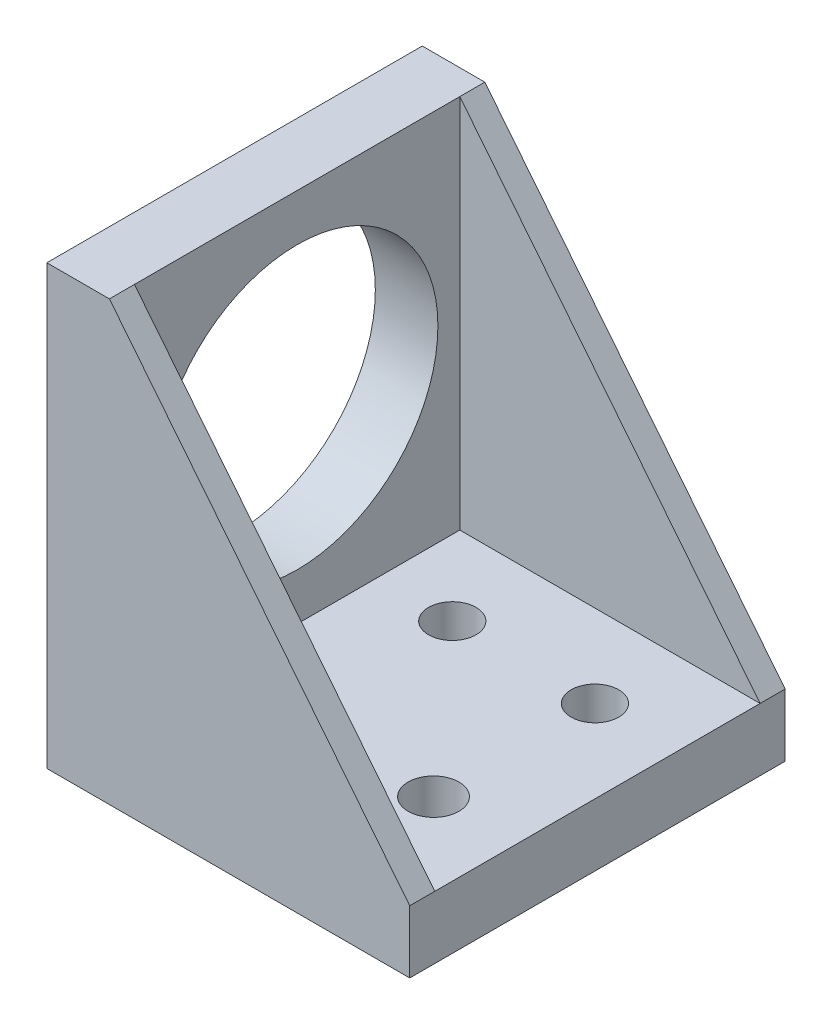
ISO-10303-21;
HEADER;
FILE_DESCRIPTION(('STEP AP214'),'2;1');
FILE_NAME('part.step','',(''),(''),'','','');
FILE_SCHEMA(('AUTOMOTIVE_DESIGN { 1 0 10303 214 1 1 1 1 }'));
ENDSEC;
DATA;
#1=APPLICATION_CONTEXT('core data for automotive mechanical design processes');
#2=APPLICATION_PROTOCOL_DEFINITION('international standard','automotive_design',2000,#1);
#3=PRODUCT_CONTEXT('',#1,'mechanical');
#4=PRODUCT('Part','Part','',(#3));
#5=PRODUCT_RELATED_PRODUCT_CATEGORY('part','',(#4));
#6=PRODUCT_DEFINITION_FORMATION('','',#4);
#7=PRODUCT_DEFINITION_CONTEXT('part definition',#1,'design');
#8=PRODUCT_DEFINITION('design','',#6,#7);
#9=PRODUCT_DEFINITION_SHAPE('','',#8);
#10=(LENGTH_UNIT() NAMED_UNIT(*) SI_UNIT(.MILLI.,.METRE.));
#11=(NAMED_UNIT(*) PLANE_ANGLE_UNIT() SI_UNIT($,.RADIAN.));
#12=(NAMED_UNIT(*) SI_UNIT($,.STERADIAN.) SOLID_ANGLE_UNIT());
#13=UNCERTAINTY_MEASURE_WITH_UNIT(LENGTH_MEASURE(1.E-05),#10,'distance_accuracy_value','');
#14=(GEOMETRIC_REPRESENTATION_CONTEXT(3) GLOBAL_UNCERTAINTY_ASSIGNED_CONTEXT((#13)) GLOBAL_UNIT_ASSIGNED_CONTEXT((#10,
#11,#12)) REPRESENTATION_CONTEXT('',''));
#15=CARTESIAN_POINT('',(0.,0.,0.));
#16=DIRECTION('',(0.,0.,1.));
#17=DIRECTION('',(1.,0.,0.));
#18=AXIS2_PLACEMENT_3D('',#15,#16,#17);
#19=CARTESIAN_POINT('',(30.48,0.,-19.05));
#20=DIRECTION('',(0.,0.,-1.));
#21=DIRECTION('',(0.,1.,0.));
#22=AXIS2_PLACEMENT_3D('',#19,#20,#21);
#23=PLANE('',#22);
#24=DIRECTION('',(-1.,0.,0.));
#25=VECTOR('',#24,1.);
#26=CARTESIAN_POINT('',(30.48,-25.4,-19.05));
#27=LINE('',#26,#25);
#28=CARTESIAN_POINT('',(30.48,-25.4,-19.05));
#29=VERTEX_POINT('',#28);
#30=CARTESIAN_POINT('',(-6.35,-25.4,-19.05));
#31=VERTEX_POINT('',#30);
#32=EDGE_CURVE('E49',#29,#31,#27,.T.);
#33=ORIENTED_EDGE('',*,*,#32,.T.);
#34=DIRECTION('',(0.,1.,0.));
#35=VECTOR('',#34,1.);
#36=CARTESIAN_POINT('',(-6.35,-25.4,-19.05));
#37=LINE('',#36,#35);
#38=CARTESIAN_POINT('',(-6.35,19.05,-19.05));
#39=VERTEX_POINT('',#38);
#40=EDGE_CURVE('E158',#31,#39,#37,.T.);
#41=ORIENTED_EDGE('',*,*,#40,.T.);
#42=DIRECTION('',(1.,0.,0.));
#43=VECTOR('',#42,1.);
#44=CARTESIAN_POINT('',(-6.35,19.05,-19.05));
#45=LINE('',#44,#43);
#46=CARTESIAN_POINT('',(0.,19.05,-19.05));
#47=VERTEX_POINT('',#46);
#48=EDGE_CURVE('E147',#39,#47,#45,.T.);
#49=ORIENTED_EDGE('',*,*,#48,.T.);
#50=DIRECTION('',(0.624695047554424,-0.78086880944303,0.));
#51=VECTOR('',#50,1.);
#52=CARTESIAN_POINT('',(0.,19.05,-19.05));
#53=LINE('',#52,#51);
#54=CARTESIAN_POINT('',(30.48,-19.05,-19.05));
#55=VERTEX_POINT('',#54);
#56=EDGE_CURVE('E112',#47,#55,#53,.T.);
#57=ORIENTED_EDGE('',*,*,#56,.T.);
#58=DIRECTION('',(0.,-1.,0.));
#59=VECTOR('',#58,1.);
#60=CARTESIAN_POINT('',(30.48,0.,-19.05));
#61=LINE('',#60,#59);
#62=EDGE_CURVE('E162',#55,#29,#61,.T.);
#63=ORIENTED_EDGE('',*,*,#62,.T.);
#64=EDGE_LOOP('',(#33,#41,#49,#57,#63));
#65=FACE_BOUND('',#64,.T.);
#66=ADVANCED_FACE('F41',(#65),#23,.T.);
#67=CARTESIAN_POINT('',(30.48,-19.05,0.));
#68=DIRECTION('',(0.,-1.,0.));
#69=DIRECTION('',(0.,0.,-1.));
#70=AXIS2_PLACEMENT_3D('',#67,#68,#69);
#71=PLANE('',#70);
#72=CARTESIAN_POINT('',(7.62,-19.05,-8.12799999999999));
#73=DIRECTION('',(0.,1.,0.));
#74=DIRECTION('',(0.,0.,1.));
#75=AXIS2_PLACEMENT_3D('',#72,#73,#74);
#76=CIRCLE('',#75,2.413);
#77=CARTESIAN_POINT('',(7.62,-19.05,-5.71499999999999));
#78=VERTEX_POINT('',#77);
#79=EDGE_CURVE('E239',#78,#78,#76,.T.);
#80=ORIENTED_EDGE('',*,*,#79,.F.);
#81=EDGE_LOOP('',(#80));
#82=FACE_BOUND('',#81,.T.);
#83=CARTESIAN_POINT('',(22.098,-19.05,-8.12799999999999));
#84=DIRECTION('',(0.,1.,0.));
#85=DIRECTION('',(0.,0.,1.));
#86=AXIS2_PLACEMENT_3D('',#83,#84,#85);
#87=CIRCLE('',#86,2.413);
#88=CARTESIAN_POINT('',(22.098,-19.05,-5.71499999999999));
#89=VERTEX_POINT('',#88);
#90=EDGE_CURVE('E247',#89,#89,#87,.T.);
#91=ORIENTED_EDGE('',*,*,#90,.F.);
#92=EDGE_LOOP('',(#91));
#93=FACE_BOUND('',#92,.T.);
#94=CARTESIAN_POINT('',(22.098,-19.05,8.25500000000001));
#95=DIRECTION('',(0.,1.,0.));
#96=DIRECTION('',(0.,0.,1.));
#97=AXIS2_PLACEMENT_3D('',#94,#95,#96);
#98=CIRCLE('',#97,2.57968749999999);
#99=CARTESIAN_POINT('',(22.098,-19.05,10.8346875));
#100=VERTEX_POINT('',#99);
#101=EDGE_CURVE('E231',#100,#100,#98,.T.);
#102=ORIENTED_EDGE('',*,*,#101,.F.);
#103=EDGE_LOOP('',(#102));
#104=FACE_BOUND('',#103,.T.);
#105=CARTESIAN_POINT('',(7.62,-19.05,8.25500000000001));
#106=DIRECTION('',(0.,1.,0.));
#107=DIRECTION('',(0.,0.,1.));
#108=AXIS2_PLACEMENT_3D('',#105,#106,#107);
#109=CIRCLE('',#108,2.413);
#110=CARTESIAN_POINT('',(7.62,-19.05,10.668));
#111=VERTEX_POINT('',#110);
#112=EDGE_CURVE('E227',#111,#111,#109,.T.);
#113=ORIENTED_EDGE('',*,*,#112,.F.);
#114=EDGE_LOOP('',(#113));
#115=FACE_BOUND('',#114,.T.);
#116=DIRECTION('',(0.,0.,1.));
#117=VECTOR('',#116,1.);
#118=CARTESIAN_POINT('',(30.48,-19.05,0.));
#119=LINE('',#118,#117);
#120=CARTESIAN_POINT('',(30.48,-19.05,-16.51));
#121=VERTEX_POINT('',#120);
#122=CARTESIAN_POINT('',(30.48,-19.05,16.51));
#123=VERTEX_POINT('',#122);
#124=EDGE_CURVE('E56',#121,#123,#119,.T.);
#125=ORIENTED_EDGE('',*,*,#124,.F.);
#126=DIRECTION('',(-1.,0.,0.));
#127=VECTOR('',#126,1.);
#128=CARTESIAN_POINT('',(30.48,-19.05,-16.51));
#129=LINE('',#128,#127);
#130=CARTESIAN_POINT('',(0.,-19.05,-16.51));
#131=VERTEX_POINT('',#130);
#132=EDGE_CURVE('E124',#121,#131,#129,.T.);
#133=ORIENTED_EDGE('',*,*,#132,.T.);
#134=DIRECTION('',(0.,0.,1.));
#135=VECTOR('',#134,1.);
#136=CARTESIAN_POINT('',(0.,-19.05,0.));
#137=LINE('',#136,#135);
#138=CARTESIAN_POINT('',(0.,-19.05,16.51));
#139=VERTEX_POINT('',#138);
#140=EDGE_CURVE('E63',#131,#139,#137,.T.);
#141=ORIENTED_EDGE('',*,*,#140,.T.);
#142=DIRECTION('',(-1.,0.,0.));
#143=VECTOR('',#142,1.);
#144=CARTESIAN_POINT('',(30.48,-19.05,16.51));
#145=LINE('',#144,#143);
#146=EDGE_CURVE('E212',#123,#139,#145,.T.);
#147=ORIENTED_EDGE('',*,*,#146,.F.);
#148=EDGE_LOOP('',(#125,#133,#141,#147));
#149=FACE_BOUND('',#148,.T.);
#150=ADVANCED_FACE('F261',(#82,#93,#104,#115,#149),#71,.F.);
#151=CARTESIAN_POINT('',(30.48,0.,19.05));
#152=DIRECTION('',(0.,0.,-1.));
#153=DIRECTION('',(0.,1.,0.));
#154=AXIS2_PLACEMENT_3D('',#151,#152,#153);
#155=PLANE('',#154);
#156=DIRECTION('',(0.,-1.,0.));
#157=VECTOR('',#156,1.);
#158=CARTESIAN_POINT('',(30.48,0.,19.05));
#159=LINE('',#158,#157);
#160=CARTESIAN_POINT('',(30.48,-19.05,19.05));
#161=VERTEX_POINT('',#160);
#162=CARTESIAN_POINT('',(30.48,-25.4,19.05));
#163=VERTEX_POINT('',#162);
#164=EDGE_CURVE('E171',#161,#163,#159,.T.);
#165=ORIENTED_EDGE('',*,*,#164,.F.);
#166=DIRECTION('',(0.624695047554424,-0.78086880944303,0.));
#167=VECTOR('',#166,1.);
#168=CARTESIAN_POINT('',(0.,19.05,19.05));
#169=LINE('',#168,#167);
#170=CARTESIAN_POINT('',(0.,19.05,19.05));
#171=VERTEX_POINT('',#170);
#172=EDGE_CURVE('E198',#171,#161,#169,.T.);
#173=ORIENTED_EDGE('',*,*,#172,.F.);
#174=DIRECTION('',(1.,0.,0.));
#175=VECTOR('',#174,1.);
#176=CARTESIAN_POINT('',(-6.35,19.05,19.05));
#177=LINE('',#176,#175);
#178=CARTESIAN_POINT('',(-6.35,19.05,19.05));
#179=VERTEX_POINT('',#178);
#180=EDGE_CURVE('E151',#179,#171,#177,.T.);
#181=ORIENTED_EDGE('',*,*,#180,.F.);
#182=DIRECTION('',(0.,1.,0.));
#183=VECTOR('',#182,1.);
#184=CARTESIAN_POINT('',(-6.35,-25.4,19.05));
#185=LINE('',#184,#183);
#186=CARTESIAN_POINT('',(-6.35,-25.4,19.05));
#187=VERTEX_POINT('',#186);
#188=EDGE_CURVE('E159',#187,#179,#185,.T.);
#189=ORIENTED_EDGE('',*,*,#188,.F.);
#190=DIRECTION('',(-1.,0.,0.));
#191=VECTOR('',#190,1.);
#192=CARTESIAN_POINT('',(30.48,-25.4,19.05));
#193=LINE('',#192,#191);
#194=EDGE_CURVE('E11',#163,#187,#193,.T.);
#195=ORIENTED_EDGE('',*,*,#194,.F.);
#196=EDGE_LOOP('',(#165,#173,#181,#189,#195));
#197=FACE_BOUND('',#196,.T.);
#198=ADVANCED_FACE('F195',(#197),#155,.F.);
#199=CARTESIAN_POINT('',(30.48,-25.4,0.));
#200=DIRECTION('',(0.,1.,0.));
#201=DIRECTION('',(0.,0.,1.));
#202=AXIS2_PLACEMENT_3D('',#199,#200,#201);
#203=PLANE('',#202);
#204=CARTESIAN_POINT('',(7.62,-25.4,-8.12799999999999));
#205=DIRECTION('',(0.,1.,0.));
#206=DIRECTION('',(0.,0.,1.));
#207=AXIS2_PLACEMENT_3D('',#204,#205,#206);
#208=CIRCLE('',#207,2.413);
#209=CARTESIAN_POINT('',(7.62,-25.4,-5.71499999999999));
#210=VERTEX_POINT('',#209);
#211=EDGE_CURVE('E235',#210,#210,#208,.T.);
#212=ORIENTED_EDGE('',*,*,#211,.T.);
#213=EDGE_LOOP('',(#212));
#214=FACE_BOUND('',#213,.T.);
#215=CARTESIAN_POINT('',(22.098,-25.4,-8.12799999999999));
#216=DIRECTION('',(0.,1.,0.));
#217=DIRECTION('',(0.,0.,1.));
#218=AXIS2_PLACEMENT_3D('',#215,#216,#217);
#219=CIRCLE('',#218,2.413);
#220=CARTESIAN_POINT('',(22.098,-25.4,-5.71499999999999));
#221=VERTEX_POINT('',#220);
#222=EDGE_CURVE('E243',#221,#221,#219,.T.);
#223=ORIENTED_EDGE('',*,*,#222,.T.);
#224=EDGE_LOOP('',(#223));
#225=FACE_BOUND('',#224,.T.);
#226=CARTESIAN_POINT('',(22.098,-25.4,8.25500000000001));
#227=DIRECTION('',(0.,1.,0.));
#228=DIRECTION('',(0.,0.,1.));
#229=AXIS2_PLACEMENT_3D('',#226,#227,#228);
#230=CIRCLE('',#229,2.57968749999999);
#231=CARTESIAN_POINT('',(22.098,-25.4,10.8346875));
#232=VERTEX_POINT('',#231);
#233=EDGE_CURVE('E251',#232,#232,#230,.T.);
#234=ORIENTED_EDGE('',*,*,#233,.T.);
#235=EDGE_LOOP('',(#234));
#236=FACE_BOUND('',#235,.T.);
#237=CARTESIAN_POINT('',(7.62,-25.4,8.25500000000001));
#238=DIRECTION('',(0.,1.,0.));
#239=DIRECTION('',(0.,0.,1.));
#240=AXIS2_PLACEMENT_3D('',#237,#238,#239);
#241=CIRCLE('',#240,2.413);
#242=CARTESIAN_POINT('',(7.62,-25.4,10.668));
#243=VERTEX_POINT('',#242);
#244=EDGE_CURVE('E224',#243,#243,#241,.T.);
#245=ORIENTED_EDGE('',*,*,#244,.T.);
#246=EDGE_LOOP('',(#245));
#247=FACE_BOUND('',#246,.T.);
#248=ORIENTED_EDGE('',*,*,#194,.T.);
#249=DIRECTION('',(0.,0.,1.));
#250=VECTOR('',#249,1.);
#251=CARTESIAN_POINT('',(-6.35,-25.4,-19.05));
#252=LINE('',#251,#250);
#253=EDGE_CURVE('E150',#31,#187,#252,.T.);
#254=ORIENTED_EDGE('',*,*,#253,.F.);
#255=ORIENTED_EDGE('',*,*,#32,.F.);
#256=DIRECTION('',(0.,0.,-1.));
#257=VECTOR('',#256,1.);
#258=CARTESIAN_POINT('',(30.48,-25.4,0.));
#259=LINE('',#258,#257);
#260=EDGE_CURVE('E174',#163,#29,#259,.T.);
#261=ORIENTED_EDGE('',*,*,#260,.F.);
#262=EDGE_LOOP('',(#248,#254,#255,#261));
#263=FACE_BOUND('',#262,.T.);
#264=ADVANCED_FACE('F189',(#214,#225,#236,#247,#263),#203,.F.);
#265=CARTESIAN_POINT('',(30.48,0.,0.));
#266=DIRECTION('',(1.,0.,0.));
#267=DIRECTION('',(0.,0.,-1.));
#268=AXIS2_PLACEMENT_3D('',#265,#266,#267);
#269=PLANE('',#268);
#270=ORIENTED_EDGE('',*,*,#62,.F.);
#271=EDGE_CURVE('E168',#55,#121,#119,.T.);
#272=ORIENTED_EDGE('',*,*,#271,.T.);
#273=ORIENTED_EDGE('',*,*,#124,.T.);
#274=DIRECTION('',(0.,0.,1.));
#275=VECTOR('',#274,1.);
#276=CARTESIAN_POINT('',(30.48,-19.05,16.51));
#277=LINE('',#276,#275);
#278=EDGE_CURVE('E206',#123,#161,#277,.T.);
#279=ORIENTED_EDGE('',*,*,#278,.T.);
#280=ORIENTED_EDGE('',*,*,#164,.T.);
#281=ORIENTED_EDGE('',*,*,#260,.T.);
#282=EDGE_LOOP('',(#270,#272,#273,#279,#280,#281));
#283=FACE_BOUND('',#282,.T.);
#284=ADVANCED_FACE('F267',(#283),#269,.T.);
#285=CARTESIAN_POINT('',(-6.35,-25.4,-19.05));
#286=DIRECTION('',(-1.,0.,0.));
#287=DIRECTION('',(0.,0.,1.));
#288=AXIS2_PLACEMENT_3D('',#285,#286,#287);
#289=PLANE('',#288);
#290=ORIENTED_EDGE('',*,*,#188,.T.);
#291=DIRECTION('',(0.,0.,1.));
#292=VECTOR('',#291,1.);
#293=CARTESIAN_POINT('',(-6.35,19.05,0.));
#294=LINE('',#293,#292);
#295=EDGE_CURVE('E154',#39,#179,#294,.T.);
#296=ORIENTED_EDGE('',*,*,#295,.F.);
#297=ORIENTED_EDGE('',*,*,#40,.F.);
#298=ORIENTED_EDGE('',*,*,#253,.T.);
#299=EDGE_LOOP('',(#290,#296,#297,#298));
#300=FACE_BOUND('',#299,.T.);
#301=CARTESIAN_POINT('',(-6.35,0.,0.));
#302=DIRECTION('',(1.,0.,0.));
#303=DIRECTION('',(0.,0.,-1.));
#304=AXIS2_PLACEMENT_3D('',#301,#302,#303);
#305=CIRCLE('',#304,14.2875);
#306=CARTESIAN_POINT('',(-6.35,0.,-14.2875));
#307=VERTEX_POINT('',#306);
#308=EDGE_CURVE('E146',#307,#307,#305,.T.);
#309=ORIENTED_EDGE('',*,*,#308,.T.);
#310=EDGE_LOOP('',(#309));
#311=FACE_BOUND('',#310,.T.);
#312=ADVANCED_FACE('F186',(#300,#311),#289,.T.);
#313=CARTESIAN_POINT('',(-6.35,19.05,0.));
#314=DIRECTION('',(0.,1.,0.));
#315=DIRECTION('',(0.,0.,1.));
#316=AXIS2_PLACEMENT_3D('',#313,#314,#315);
#317=PLANE('',#316);
#318=DIRECTION('',(0.,0.,1.));
#319=VECTOR('',#318,1.);
#320=CARTESIAN_POINT('',(0.,19.05,0.));
#321=LINE('',#320,#319);
#322=CARTESIAN_POINT('',(0.,19.05,-16.51));
#323=VERTEX_POINT('',#322);
#324=EDGE_CURVE('E106',#47,#323,#321,.T.);
#325=ORIENTED_EDGE('',*,*,#324,.F.);
#326=ORIENTED_EDGE('',*,*,#48,.F.);
#327=ORIENTED_EDGE('',*,*,#295,.T.);
#328=ORIENTED_EDGE('',*,*,#180,.T.);
#329=DIRECTION('',(0.,0.,1.));
#330=VECTOR('',#329,1.);
#331=CARTESIAN_POINT('',(0.,19.05,16.51));
#332=LINE('',#331,#330);
#333=CARTESIAN_POINT('',(0.,19.05,16.51));
#334=VERTEX_POINT('',#333);
#335=EDGE_CURVE('E135',#334,#171,#332,.T.);
#336=ORIENTED_EDGE('',*,*,#335,.F.);
#337=EDGE_CURVE('E118',#323,#334,#321,.T.);
#338=ORIENTED_EDGE('',*,*,#337,.F.);
#339=EDGE_LOOP('',(#325,#326,#327,#328,#336,#338));
#340=FACE_BOUND('',#339,.T.);
#341=ADVANCED_FACE('F133',(#340),#317,.T.);
#342=CARTESIAN_POINT('',(-6.35,0.,0.));
#343=DIRECTION('',(1.,0.,0.));
#344=DIRECTION('',(0.,0.,-1.));
#345=AXIS2_PLACEMENT_3D('',#342,#343,#344);
#346=CYLINDRICAL_SURFACE('',#345,14.2875);
#347=ORIENTED_EDGE('',*,*,#308,.F.);
#348=EDGE_LOOP('',(#347));
#349=FACE_BOUND('',#348,.T.);
#350=CARTESIAN_POINT('',(0.,0.,0.));
#351=DIRECTION('',(1.,0.,0.));
#352=DIRECTION('',(0.,0.,-1.));
#353=AXIS2_PLACEMENT_3D('',#350,#351,#352);
#354=CIRCLE('',#353,14.2875);
#355=CARTESIAN_POINT('',(0.,0.,-14.2875));
#356=VERTEX_POINT('',#355);
#357=EDGE_CURVE('E138',#356,#356,#354,.T.);
#358=ORIENTED_EDGE('',*,*,#357,.T.);
#359=EDGE_LOOP('',(#358));
#360=FACE_BOUND('',#359,.T.);
#361=ADVANCED_FACE('F324',(#349,#360),#346,.F.);
#362=CARTESIAN_POINT('',(0.,0.,0.));
#363=DIRECTION('',(1.,0.,0.));
#364=DIRECTION('',(0.,0.,-1.));
#365=AXIS2_PLACEMENT_3D('',#362,#363,#364);
#366=PLANE('',#365);
#367=DIRECTION('',(0.,1.,0.));
#368=VECTOR('',#367,1.);
#369=CARTESIAN_POINT('',(0.,-19.05,-16.51));
#370=LINE('',#369,#368);
#371=EDGE_CURVE('E123',#131,#323,#370,.T.);
#372=ORIENTED_EDGE('',*,*,#371,.T.);
#373=ORIENTED_EDGE('',*,*,#337,.T.);
#374=DIRECTION('',(0.,1.,0.));
#375=VECTOR('',#374,1.);
#376=CARTESIAN_POINT('',(0.,-19.05,16.51));
#377=LINE('',#376,#375);
#378=EDGE_CURVE('E216',#139,#334,#377,.T.);
#379=ORIENTED_EDGE('',*,*,#378,.F.);
#380=ORIENTED_EDGE('',*,*,#140,.F.);
#381=EDGE_LOOP('',(#372,#373,#379,#380));
#382=FACE_BOUND('',#381,.T.);
#383=ORIENTED_EDGE('',*,*,#357,.F.);
#384=EDGE_LOOP('',(#383));
#385=FACE_BOUND('',#384,.T.);
#386=ADVANCED_FACE('F128',(#382,#385),#366,.T.);
#387=CARTESIAN_POINT('',(0.,19.05,16.51));
#388=DIRECTION('',(-0.78086880944303,-0.624695047554424,0.));
#389=DIRECTION('',(0.624695047554424,-0.78086880944303,0.));
#390=AXIS2_PLACEMENT_3D('',#387,#388,#389);
#391=PLANE('',#390);
#392=ORIENTED_EDGE('',*,*,#172,.T.);
#393=ORIENTED_EDGE('',*,*,#278,.F.);
#394=DIRECTION('',(0.624695047554424,-0.78086880944303,0.));
#395=VECTOR('',#394,1.);
#396=CARTESIAN_POINT('',(0.,19.05,16.51));
#397=LINE('',#396,#395);
#398=EDGE_CURVE('E209',#334,#123,#397,.T.);
#399=ORIENTED_EDGE('',*,*,#398,.F.);
#400=ORIENTED_EDGE('',*,*,#335,.T.);
#401=EDGE_LOOP('',(#392,#393,#399,#400));
#402=FACE_BOUND('',#401,.T.);
#403=ADVANCED_FACE('F270',(#402),#391,.F.);
#404=CARTESIAN_POINT('',(0.,0.,16.51));
#405=DIRECTION('',(0.,0.,-1.));
#406=DIRECTION('',(-1.,0.,0.));
#407=AXIS2_PLACEMENT_3D('',#404,#405,#406);
#408=PLANE('',#407);
#409=ORIENTED_EDGE('',*,*,#146,.T.);
#410=ORIENTED_EDGE('',*,*,#378,.T.);
#411=ORIENTED_EDGE('',*,*,#398,.T.);
#412=EDGE_LOOP('',(#409,#410,#411));
#413=FACE_BOUND('',#412,.T.);
#414=ADVANCED_FACE('F273',(#413),#408,.T.);
#415=CARTESIAN_POINT('',(0.,19.05,-16.51));
#416=DIRECTION('',(0.78086880944303,0.624695047554424,0.));
#417=DIRECTION('',(-0.624695047554424,0.78086880944303,0.));
#418=AXIS2_PLACEMENT_3D('',#415,#416,#417);
#419=PLANE('',#418);
#420=ORIENTED_EDGE('',*,*,#56,.F.);
#421=ORIENTED_EDGE('',*,*,#324,.T.);
#422=DIRECTION('',(0.624695047554424,-0.78086880944303,0.));
#423=VECTOR('',#422,1.);
#424=CARTESIAN_POINT('',(0.,19.05,-16.51));
#425=LINE('',#424,#423);
#426=EDGE_CURVE('E109',#323,#121,#425,.T.);
#427=ORIENTED_EDGE('',*,*,#426,.T.);
#428=ORIENTED_EDGE('',*,*,#271,.F.);
#429=EDGE_LOOP('',(#420,#421,#427,#428));
#430=FACE_BOUND('',#429,.T.);
#431=ADVANCED_FACE('F108',(#430),#419,.T.);
#432=CARTESIAN_POINT('',(0.,0.,-16.51));
#433=DIRECTION('',(0.,0.,1.));
#434=DIRECTION('',(1.,0.,0.));
#435=AXIS2_PLACEMENT_3D('',#432,#433,#434);
#436=PLANE('',#435);
#437=ORIENTED_EDGE('',*,*,#371,.F.);
#438=ORIENTED_EDGE('',*,*,#132,.F.);
#439=ORIENTED_EDGE('',*,*,#426,.F.);
#440=EDGE_LOOP('',(#437,#438,#439));
#441=FACE_BOUND('',#440,.T.);
#442=ADVANCED_FACE('F122',(#441),#436,.T.);
#443=CARTESIAN_POINT('',(7.62,-25.4,8.25500000000001));
#444=DIRECTION('',(0.,1.,0.));
#445=DIRECTION('',(0.,0.,1.));
#446=AXIS2_PLACEMENT_3D('',#443,#444,#445);
#447=CYLINDRICAL_SURFACE('',#446,2.413);
#448=ORIENTED_EDGE('',*,*,#244,.F.);
#449=EDGE_LOOP('',(#448));
#450=FACE_BOUND('',#449,.T.);
#451=ORIENTED_EDGE('',*,*,#112,.T.);
#452=EDGE_LOOP('',(#451));
#453=FACE_BOUND('',#452,.T.);
#454=ADVANCED_FACE('F364',(#450,#453),#447,.F.);
#455=CARTESIAN_POINT('',(22.098,-25.4,8.25500000000001));
#456=DIRECTION('',(0.,1.,0.));
#457=DIRECTION('',(0.,0.,1.));
#458=AXIS2_PLACEMENT_3D('',#455,#456,#457);
#459=CYLINDRICAL_SURFACE('',#458,2.57968749999999);
#460=ORIENTED_EDGE('',*,*,#233,.F.);
#461=EDGE_LOOP('',(#460));
#462=FACE_BOUND('',#461,.T.);
#463=ORIENTED_EDGE('',*,*,#101,.T.);
#464=EDGE_LOOP('',(#463));
#465=FACE_BOUND('',#464,.T.);
#466=ADVANCED_FACE('F259',(#462,#465),#459,.F.);
#467=CARTESIAN_POINT('',(22.098,-25.4,-8.12799999999999));
#468=DIRECTION('',(0.,1.,0.));
#469=DIRECTION('',(0.,0.,1.));
#470=AXIS2_PLACEMENT_3D('',#467,#468,#469);
#471=CYLINDRICAL_SURFACE('',#470,2.413);
#472=ORIENTED_EDGE('',*,*,#222,.F.);
#473=EDGE_LOOP('',(#472));
#474=FACE_BOUND('',#473,.T.);
#475=ORIENTED_EDGE('',*,*,#90,.T.);
#476=EDGE_LOOP('',(#475));
#477=FACE_BOUND('',#476,.T.);
#478=ADVANCED_FACE('F379',(#474,#477),#471,.F.);
#479=CARTESIAN_POINT('',(7.62,-25.4,-8.12799999999999));
#480=DIRECTION('',(0.,1.,0.));
#481=DIRECTION('',(0.,0.,1.));
#482=AXIS2_PLACEMENT_3D('',#479,#480,#481);
#483=CYLINDRICAL_SURFACE('',#482,2.413);
#484=ORIENTED_EDGE('',*,*,#211,.F.);
#485=EDGE_LOOP('',(#484));
#486=FACE_BOUND('',#485,.T.);
#487=ORIENTED_EDGE('',*,*,#79,.T.);
#488=EDGE_LOOP('',(#487));
#489=FACE_BOUND('',#488,.T.);
#490=ADVANCED_FACE('F388',(#486,#489),#483,.F.);
#491=CLOSED_SHELL('',(#66,#150,#198,#264,#284,#312,#341,#361,#386,#403,#414,#431,#442,#454,#466,
#478,#490));
#492=MANIFOLD_SOLID_BREP('B2',#491);
#493=ADVANCED_BREP_SHAPE_REPRESENTATION('',(#18,#492),#14);
#494=SHAPE_DEFINITION_REPRESENTATION(#9,#493);
ENDSEC;
END-ISO-10303-21;
